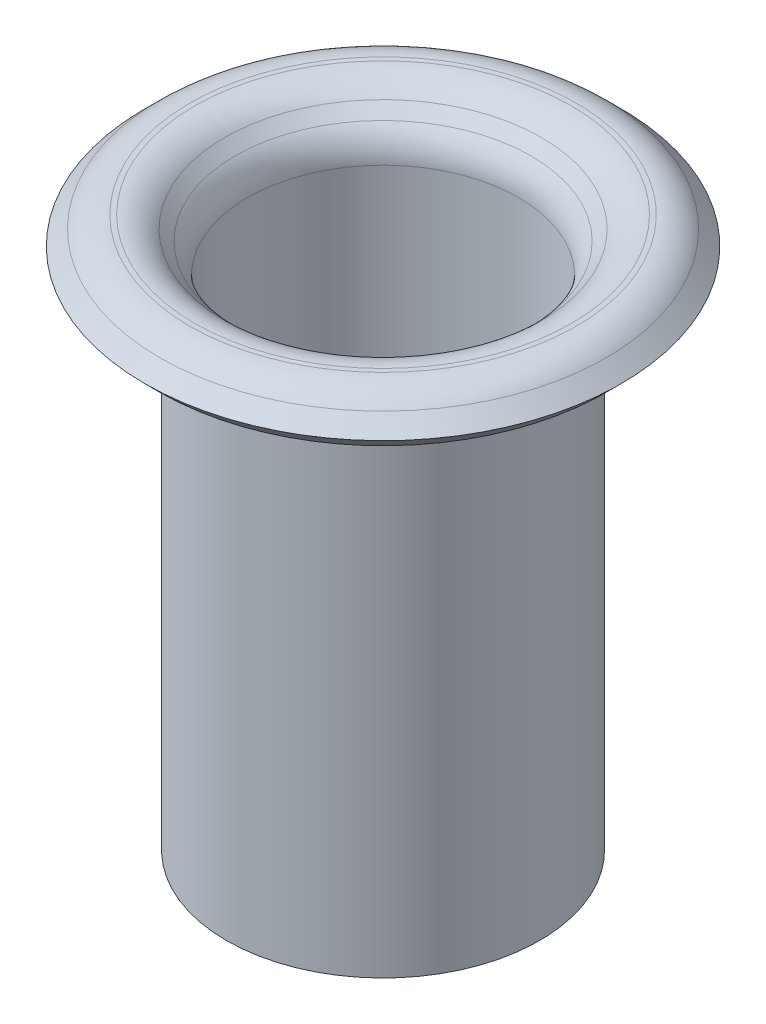
ISO-10303-21;
HEADER;
FILE_DESCRIPTION(('STEP AP214'),'2;1');
FILE_NAME('part.step','',(''),(''),'','','');
FILE_SCHEMA(('AUTOMOTIVE_DESIGN { 1 0 10303 214 1 1 1 1 }'));
ENDSEC;
DATA;
#1=APPLICATION_CONTEXT('core data for automotive mechanical design processes');
#2=APPLICATION_PROTOCOL_DEFINITION('international standard','automotive_design',2000,#1);
#3=PRODUCT_CONTEXT('',#1,'mechanical');
#4=PRODUCT('Part','Part','',(#3));
#5=PRODUCT_RELATED_PRODUCT_CATEGORY('part','',(#4));
#6=PRODUCT_DEFINITION_FORMATION('','',#4);
#7=PRODUCT_DEFINITION_CONTEXT('part definition',#1,'design');
#8=PRODUCT_DEFINITION('design','',#6,#7);
#9=PRODUCT_DEFINITION_SHAPE('','',#8);
#10=(LENGTH_UNIT() NAMED_UNIT(*) SI_UNIT(.MILLI.,.METRE.));
#11=(NAMED_UNIT(*) PLANE_ANGLE_UNIT() SI_UNIT($,.RADIAN.));
#12=(NAMED_UNIT(*) SI_UNIT($,.STERADIAN.) SOLID_ANGLE_UNIT());
#13=UNCERTAINTY_MEASURE_WITH_UNIT(LENGTH_MEASURE(1.E-05),#10,'distance_accuracy_value','');
#14=(GEOMETRIC_REPRESENTATION_CONTEXT(3) GLOBAL_UNCERTAINTY_ASSIGNED_CONTEXT((#13)) GLOBAL_UNIT_ASSIGNED_CONTEXT((#10,
#11,#12)) REPRESENTATION_CONTEXT('',''));
#15=CARTESIAN_POINT('',(0.,0.,0.));
#16=DIRECTION('',(0.,0.,1.));
#17=DIRECTION('',(1.,0.,0.));
#18=AXIS2_PLACEMENT_3D('',#15,#16,#17);
#19=CARTESIAN_POINT('',(-1.28,-5.2,0.));
#20=DIRECTION('',(0.,-1.,0.));
#21=DIRECTION('',(0.,0.,-1.));
#22=AXIS2_PLACEMENT_3D('',#19,#20,#21);
#23=PLANE('',#22);
#24=CARTESIAN_POINT('',(0.,-5.2,0.));
#25=DIRECTION('',(0.,1.,0.));
#26=DIRECTION('',(0.,0.,1.));
#27=AXIS2_PLACEMENT_3D('',#24,#25,#26);
#28=CIRCLE('',#27,1.28);
#29=CARTESIAN_POINT('',(0.,-5.2,1.28));
#30=VERTEX_POINT('',#29);
#31=EDGE_CURVE('E83',#30,#30,#28,.T.);
#32=ORIENTED_EDGE('',*,*,#31,.T.);
#33=EDGE_LOOP('',(#32));
#34=FACE_BOUND('',#33,.T.);
#35=CARTESIAN_POINT('',(0.,-5.2,0.));
#36=DIRECTION('',(0.,1.,0.));
#37=DIRECTION('',(0.,0.,1.));
#38=AXIS2_PLACEMENT_3D('',#35,#36,#37);
#39=CIRCLE('',#38,1.48);
#40=CARTESIAN_POINT('',(0.,-5.2,1.48));
#41=VERTEX_POINT('',#40);
#42=EDGE_CURVE('E10',#41,#41,#39,.T.);
#43=ORIENTED_EDGE('',*,*,#42,.F.);
#44=EDGE_LOOP('',(#43));
#45=FACE_BOUND('',#44,.T.);
#46=ADVANCED_FACE('F31',(#34,#45),#23,.T.);
#47=CARTESIAN_POINT('',(0.,0.,0.));
#48=DIRECTION('',(0.,1.,0.));
#49=DIRECTION('',(0.,0.,1.));
#50=AXIS2_PLACEMENT_3D('',#47,#48,#49);
#51=CYLINDRICAL_SURFACE('',#50,1.48);
#52=ORIENTED_EDGE('',*,*,#42,.T.);
#53=EDGE_LOOP('',(#52));
#54=FACE_BOUND('',#53,.T.);
#55=CARTESIAN_POINT('',(0.,-0.5,0.));
#56=DIRECTION('',(0.,1.,0.));
#57=DIRECTION('',(0.,0.,1.));
#58=AXIS2_PLACEMENT_3D('',#55,#56,#57);
#59=CIRCLE('',#58,1.48);
#60=CARTESIAN_POINT('',(0.,-0.5,1.48));
#61=VERTEX_POINT('',#60);
#62=EDGE_CURVE('E37',#61,#61,#59,.T.);
#63=ORIENTED_EDGE('',*,*,#62,.F.);
#64=EDGE_LOOP('',(#63));
#65=FACE_BOUND('',#64,.T.);
#66=ADVANCED_FACE('F101',(#54,#65),#51,.T.);
#67=CARTESIAN_POINT('',(0.,-0.5,0.));
#68=DIRECTION('',(0.,1.,0.));
#69=DIRECTION('',(0.,0.,1.));
#70=AXIS2_PLACEMENT_3D('',#67,#68,#69);
#71=TOROIDAL_SURFACE('',#70,1.68,0.2);
#72=ORIENTED_EDGE('',*,*,#62,.T.);
#73=EDGE_LOOP('',(#72));
#74=FACE_BOUND('',#73,.T.);
#75=CARTESIAN_POINT('',(0.,-0.35857864376269,0.));
#76=DIRECTION('',(0.,1.,0.));
#77=DIRECTION('',(0.,0.,1.));
#78=AXIS2_PLACEMENT_3D('',#75,#76,#77);
#79=CIRCLE('',#78,1.53857864376269);
#80=CARTESIAN_POINT('',(0.,-0.35857864376269,1.53857864376269));
#81=VERTEX_POINT('',#80);
#82=EDGE_CURVE('E41',#81,#81,#79,.T.);
#83=ORIENTED_EDGE('',*,*,#82,.F.);
#84=EDGE_LOOP('',(#83));
#85=FACE_BOUND('',#84,.T.);
#86=ADVANCED_FACE('F105',(#74,#85),#71,.F.);
#87=CARTESIAN_POINT('',(0.,-0.25857864376269,0.));
#88=DIRECTION('',(0.,1.,0.));
#89=DIRECTION('',(0.,0.,1.));
#90=AXIS2_PLACEMENT_3D('',#87,#88,#89);
#91=CONICAL_SURFACE('',#90,1.63857864376269,0.78539816339745);
#92=ORIENTED_EDGE('',*,*,#82,.T.);
#93=EDGE_LOOP('',(#92));
#94=FACE_BOUND('',#93,.T.);
#95=CARTESIAN_POINT('',(0.,-0.25857864376269,0.));
#96=DIRECTION('',(0.,1.,0.));
#97=DIRECTION('',(0.,0.,1.));
#98=AXIS2_PLACEMENT_3D('',#95,#96,#97);
#99=CIRCLE('',#98,1.63857864376269);
#100=CARTESIAN_POINT('',(0.,-0.25857864376269,1.63857864376269));
#101=VERTEX_POINT('',#100);
#102=EDGE_CURVE('E45',#101,#101,#99,.T.);
#103=ORIENTED_EDGE('',*,*,#102,.F.);
#104=EDGE_LOOP('',(#103));
#105=FACE_BOUND('',#104,.T.);
#106=ADVANCED_FACE('F109',(#94,#105),#91,.T.);
#107=CARTESIAN_POINT('',(0.,-0.4,0.));
#108=DIRECTION('',(0.,1.,0.));
#109=DIRECTION('',(0.,0.,1.));
#110=AXIS2_PLACEMENT_3D('',#107,#108,#109);
#111=TOROIDAL_SURFACE('',#110,1.78,0.2);
#112=ORIENTED_EDGE('',*,*,#102,.T.);
#113=EDGE_LOOP('',(#112));
#114=FACE_BOUND('',#113,.T.);
#115=CARTESIAN_POINT('',(0.,-0.2,0.));
#116=DIRECTION('',(0.,1.,0.));
#117=DIRECTION('',(0.,0.,1.));
#118=AXIS2_PLACEMENT_3D('',#115,#116,#117);
#119=CIRCLE('',#118,1.78);
#120=CARTESIAN_POINT('',(0.,-0.2,1.78));
#121=VERTEX_POINT('',#120);
#122=EDGE_CURVE('E50',#121,#121,#119,.T.);
#123=ORIENTED_EDGE('',*,*,#122,.F.);
#124=EDGE_LOOP('',(#123));
#125=FACE_BOUND('',#124,.T.);
#126=ADVANCED_FACE('F115',(#114,#125),#111,.F.);
#127=CARTESIAN_POINT('',(-1.82573593128807,-0.2,0.));
#128=DIRECTION('',(0.,-1.,0.));
#129=DIRECTION('',(0.,0.,-1.));
#130=AXIS2_PLACEMENT_3D('',#127,#128,#129);
#131=PLANE('',#130);
#132=ORIENTED_EDGE('',*,*,#122,.T.);
#133=EDGE_LOOP('',(#132));
#134=FACE_BOUND('',#133,.T.);
#135=CARTESIAN_POINT('',(0.,-0.2,0.));
#136=DIRECTION('',(0.,1.,0.));
#137=DIRECTION('',(0.,0.,1.));
#138=AXIS2_PLACEMENT_3D('',#135,#136,#137);
#139=CIRCLE('',#138,1.82573593128807);
#140=CARTESIAN_POINT('',(0.,-0.2,1.82573593128807));
#141=VERTEX_POINT('',#140);
#142=EDGE_CURVE('E53',#141,#141,#139,.T.);
#143=ORIENTED_EDGE('',*,*,#142,.F.);
#144=EDGE_LOOP('',(#143));
#145=FACE_BOUND('',#144,.T.);
#146=ADVANCED_FACE('F119',(#134,#145),#131,.T.);
#147=CARTESIAN_POINT('',(0.,-0.4,0.));
#148=DIRECTION('',(0.,1.,0.));
#149=DIRECTION('',(0.,0.,1.));
#150=AXIS2_PLACEMENT_3D('',#147,#148,#149);
#151=TOROIDAL_SURFACE('',#150,1.82573593128807,0.2);
#152=ORIENTED_EDGE('',*,*,#142,.T.);
#153=EDGE_LOOP('',(#152));
#154=FACE_BOUND('',#153,.T.);
#155=CARTESIAN_POINT('',(0.,-0.258578643762691,0.));
#156=DIRECTION('',(0.,1.,0.));
#157=DIRECTION('',(0.,0.,1.));
#158=AXIS2_PLACEMENT_3D('',#155,#156,#157);
#159=CIRCLE('',#158,1.96715728752538);
#160=CARTESIAN_POINT('',(0.,-0.258578643762691,1.96715728752538));
#161=VERTEX_POINT('',#160);
#162=EDGE_CURVE('E56',#161,#161,#159,.T.);
#163=ORIENTED_EDGE('',*,*,#162,.F.);
#164=EDGE_LOOP('',(#163));
#165=FACE_BOUND('',#164,.T.);
#166=ADVANCED_FACE('F123',(#154,#165),#151,.F.);
#167=CARTESIAN_POINT('',(0.,-0.4,0.));
#168=DIRECTION('',(0.,-1.,0.));
#169=DIRECTION('',(0.,0.,-1.));
#170=AXIS2_PLACEMENT_3D('',#167,#168,#169);
#171=CONICAL_SURFACE('',#170,2.10857864376269,0.785398163397447);
#172=ORIENTED_EDGE('',*,*,#162,.T.);
#173=EDGE_LOOP('',(#172));
#174=FACE_BOUND('',#173,.T.);
#175=CARTESIAN_POINT('',(0.,-0.4,0.));
#176=DIRECTION('',(0.,1.,0.));
#177=DIRECTION('',(0.,0.,1.));
#178=AXIS2_PLACEMENT_3D('',#175,#176,#177);
#179=CIRCLE('',#178,2.10857864376269);
#180=CARTESIAN_POINT('',(0.,-0.4,2.10857864376269));
#181=VERTEX_POINT('',#180);
#182=EDGE_CURVE('E59',#181,#181,#179,.T.);
#183=ORIENTED_EDGE('',*,*,#182,.F.);
#184=EDGE_LOOP('',(#183));
#185=FACE_BOUND('',#184,.T.);
#186=ADVANCED_FACE('F127',(#174,#185),#171,.F.);
#187=CARTESIAN_POINT('',(0.,-0.258578643762691,0.));
#188=DIRECTION('',(0.,1.,0.));
#189=DIRECTION('',(0.,0.,1.));
#190=AXIS2_PLACEMENT_3D('',#187,#188,#189);
#191=CONICAL_SURFACE('',#190,2.25,0.78539816339745);
#192=ORIENTED_EDGE('',*,*,#182,.T.);
#193=EDGE_LOOP('',(#192));
#194=FACE_BOUND('',#193,.T.);
#195=CARTESIAN_POINT('',(0.,-0.258578643762691,0.));
#196=DIRECTION('',(0.,1.,0.));
#197=DIRECTION('',(0.,0.,1.));
#198=AXIS2_PLACEMENT_3D('',#195,#196,#197);
#199=CIRCLE('',#198,2.25);
#200=CARTESIAN_POINT('',(0.,-0.258578643762691,2.25));
#201=VERTEX_POINT('',#200);
#202=EDGE_CURVE('E62',#201,#201,#199,.T.);
#203=ORIENTED_EDGE('',*,*,#202,.F.);
#204=EDGE_LOOP('',(#203));
#205=FACE_BOUND('',#204,.T.);
#206=ADVANCED_FACE('F131',(#194,#205),#191,.T.);
#207=CARTESIAN_POINT('',(0.,-0.117157287525382,0.));
#208=DIRECTION('',(0.,-1.,0.));
#209=DIRECTION('',(0.,0.,-1.));
#210=AXIS2_PLACEMENT_3D('',#207,#208,#209);
#211=CONICAL_SURFACE('',#210,2.10857864376269,0.78539816339745);
#212=ORIENTED_EDGE('',*,*,#202,.T.);
#213=EDGE_LOOP('',(#212));
#214=FACE_BOUND('',#213,.T.);
#215=CARTESIAN_POINT('',(0.,-0.117157287525382,0.));
#216=DIRECTION('',(0.,1.,0.));
#217=DIRECTION('',(0.,0.,1.));
#218=AXIS2_PLACEMENT_3D('',#215,#216,#217);
#219=CIRCLE('',#218,2.10857864376269);
#220=CARTESIAN_POINT('',(0.,-0.117157287525382,2.10857864376269));
#221=VERTEX_POINT('',#220);
#222=EDGE_CURVE('E65',#221,#221,#219,.T.);
#223=ORIENTED_EDGE('',*,*,#222,.F.);
#224=EDGE_LOOP('',(#223));
#225=FACE_BOUND('',#224,.T.);
#226=ADVANCED_FACE('F135',(#214,#225),#211,.T.);
#227=CARTESIAN_POINT('',(0.,-0.4,0.));
#228=DIRECTION('',(0.,1.,0.));
#229=DIRECTION('',(0.,0.,1.));
#230=AXIS2_PLACEMENT_3D('',#227,#228,#229);
#231=TOROIDAL_SURFACE('',#230,1.82573593128807,0.4);
#232=ORIENTED_EDGE('',*,*,#222,.T.);
#233=EDGE_LOOP('',(#232));
#234=FACE_BOUND('',#233,.T.);
#235=CARTESIAN_POINT('',(0.,0.,0.));
#236=DIRECTION('',(0.,1.,0.));
#237=DIRECTION('',(0.,0.,1.));
#238=AXIS2_PLACEMENT_3D('',#235,#236,#237);
#239=CIRCLE('',#238,1.82573593128807);
#240=CARTESIAN_POINT('',(0.,0.,1.82573593128807));
#241=VERTEX_POINT('',#240);
#242=EDGE_CURVE('E68',#241,#241,#239,.T.);
#243=ORIENTED_EDGE('',*,*,#242,.F.);
#244=EDGE_LOOP('',(#243));
#245=FACE_BOUND('',#244,.T.);
#246=ADVANCED_FACE('F139',(#234,#245),#231,.T.);
#247=CARTESIAN_POINT('',(-1.82573593128807,0.,0.));
#248=DIRECTION('',(0.,1.,0.));
#249=DIRECTION('',(0.,0.,1.));
#250=AXIS2_PLACEMENT_3D('',#247,#248,#249);
#251=PLANE('',#250);
#252=ORIENTED_EDGE('',*,*,#242,.T.);
#253=EDGE_LOOP('',(#252));
#254=FACE_BOUND('',#253,.T.);
#255=CARTESIAN_POINT('',(0.,0.,0.));
#256=DIRECTION('',(0.,1.,0.));
#257=DIRECTION('',(0.,0.,1.));
#258=AXIS2_PLACEMENT_3D('',#255,#256,#257);
#259=CIRCLE('',#258,1.78);
#260=CARTESIAN_POINT('',(0.,0.,1.78));
#261=VERTEX_POINT('',#260);
#262=EDGE_CURVE('E71',#261,#261,#259,.T.);
#263=ORIENTED_EDGE('',*,*,#262,.F.);
#264=EDGE_LOOP('',(#263));
#265=FACE_BOUND('',#264,.T.);
#266=ADVANCED_FACE('F143',(#254,#265),#251,.T.);
#267=CARTESIAN_POINT('',(0.,-0.4,0.));
#268=DIRECTION('',(0.,1.,0.));
#269=DIRECTION('',(0.,0.,1.));
#270=AXIS2_PLACEMENT_3D('',#267,#268,#269);
#271=TOROIDAL_SURFACE('',#270,1.78,0.4);
#272=ORIENTED_EDGE('',*,*,#262,.T.);
#273=EDGE_LOOP('',(#272));
#274=FACE_BOUND('',#273,.T.);
#275=CARTESIAN_POINT('',(0.,-0.117157287525381,0.));
#276=DIRECTION('',(0.,1.,0.));
#277=DIRECTION('',(0.,0.,1.));
#278=AXIS2_PLACEMENT_3D('',#275,#276,#277);
#279=CIRCLE('',#278,1.49715728752538);
#280=CARTESIAN_POINT('',(0.,-0.117157287525381,1.49715728752538));
#281=VERTEX_POINT('',#280);
#282=EDGE_CURVE('E74',#281,#281,#279,.T.);
#283=ORIENTED_EDGE('',*,*,#282,.F.);
#284=EDGE_LOOP('',(#283));
#285=FACE_BOUND('',#284,.T.);
#286=ADVANCED_FACE('F147',(#274,#285),#271,.T.);
#287=CARTESIAN_POINT('',(0.,-0.217157287525381,0.));
#288=DIRECTION('',(0.,1.,0.));
#289=DIRECTION('',(0.,0.,1.));
#290=AXIS2_PLACEMENT_3D('',#287,#288,#289);
#291=CONICAL_SURFACE('',#290,1.39715728752538,0.785398163397451);
#292=ORIENTED_EDGE('',*,*,#282,.T.);
#293=EDGE_LOOP('',(#292));
#294=FACE_BOUND('',#293,.T.);
#295=CARTESIAN_POINT('',(0.,-0.217157287525381,0.));
#296=DIRECTION('',(0.,1.,0.));
#297=DIRECTION('',(0.,0.,1.));
#298=AXIS2_PLACEMENT_3D('',#295,#296,#297);
#299=CIRCLE('',#298,1.39715728752538);
#300=CARTESIAN_POINT('',(0.,-0.217157287525381,1.39715728752538));
#301=VERTEX_POINT('',#300);
#302=EDGE_CURVE('E77',#301,#301,#299,.T.);
#303=ORIENTED_EDGE('',*,*,#302,.F.);
#304=EDGE_LOOP('',(#303));
#305=FACE_BOUND('',#304,.T.);
#306=ADVANCED_FACE('F97',(#294,#305),#291,.F.);
#307=CARTESIAN_POINT('',(0.,-0.5,0.));
#308=DIRECTION('',(0.,1.,0.));
#309=DIRECTION('',(0.,0.,1.));
#310=AXIS2_PLACEMENT_3D('',#307,#308,#309);
#311=TOROIDAL_SURFACE('',#310,1.68,0.4);
#312=ORIENTED_EDGE('',*,*,#302,.T.);
#313=EDGE_LOOP('',(#312));
#314=FACE_BOUND('',#313,.T.);
#315=CARTESIAN_POINT('',(0.,-0.5,0.));
#316=DIRECTION('',(0.,1.,0.));
#317=DIRECTION('',(0.,0.,1.));
#318=AXIS2_PLACEMENT_3D('',#315,#316,#317);
#319=CIRCLE('',#318,1.28);
#320=CARTESIAN_POINT('',(0.,-0.5,1.28));
#321=VERTEX_POINT('',#320);
#322=EDGE_CURVE('E80',#321,#321,#319,.T.);
#323=ORIENTED_EDGE('',*,*,#322,.F.);
#324=EDGE_LOOP('',(#323));
#325=FACE_BOUND('',#324,.T.);
#326=ADVANCED_FACE('F91',(#314,#325),#311,.T.);
#327=CARTESIAN_POINT('',(0.,0.,0.));
#328=DIRECTION('',(0.,1.,0.));
#329=DIRECTION('',(0.,0.,1.));
#330=AXIS2_PLACEMENT_3D('',#327,#328,#329);
#331=CYLINDRICAL_SURFACE('',#330,1.28);
#332=ORIENTED_EDGE('',*,*,#322,.T.);
#333=EDGE_LOOP('',(#332));
#334=FACE_BOUND('',#333,.T.);
#335=ORIENTED_EDGE('',*,*,#31,.F.);
#336=EDGE_LOOP('',(#335));
#337=FACE_BOUND('',#336,.T.);
#338=ADVANCED_FACE('F89',(#334,#337),#331,.F.);
#339=CLOSED_SHELL('',(#46,#66,#86,#106,#126,#146,#166,#186,#206,#226,#246,#266,#286,#306,#326,#338));
#340=MANIFOLD_SOLID_BREP('B2',#339);
#341=ADVANCED_BREP_SHAPE_REPRESENTATION('',(#18,#340),#14);
#342=SHAPE_DEFINITION_REPRESENTATION(#9,#341);
ENDSEC;
END-ISO-10303-21;
